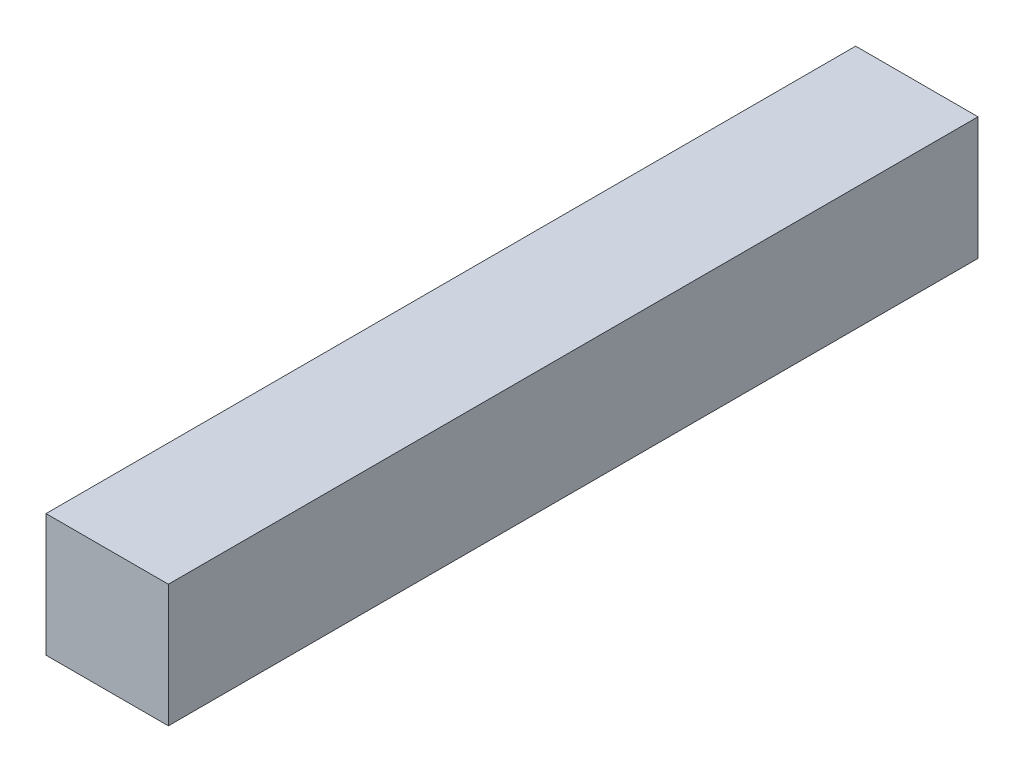
ISO-10303-21;
HEADER;
FILE_DESCRIPTION(('STEP AP214'),'2;1');
FILE_NAME('part.step','',(''),(''),'','','');
FILE_SCHEMA(('AUTOMOTIVE_DESIGN { 1 0 10303 214 1 1 1 1 }'));
ENDSEC;
DATA;
#1=APPLICATION_CONTEXT('core data for automotive mechanical design processes');
#2=APPLICATION_PROTOCOL_DEFINITION('international standard','automotive_design',2000,#1);
#3=PRODUCT_CONTEXT('',#1,'mechanical');
#4=PRODUCT('Part','Part','',(#3));
#5=PRODUCT_RELATED_PRODUCT_CATEGORY('part','',(#4));
#6=PRODUCT_DEFINITION_FORMATION('','',#4);
#7=PRODUCT_DEFINITION_CONTEXT('part definition',#1,'design');
#8=PRODUCT_DEFINITION('design','',#6,#7);
#9=PRODUCT_DEFINITION_SHAPE('','',#8);
#10=(LENGTH_UNIT() NAMED_UNIT(*) SI_UNIT(.MILLI.,.METRE.));
#11=(NAMED_UNIT(*) PLANE_ANGLE_UNIT() SI_UNIT($,.RADIAN.));
#12=(NAMED_UNIT(*) SI_UNIT($,.STERADIAN.) SOLID_ANGLE_UNIT());
#13=UNCERTAINTY_MEASURE_WITH_UNIT(LENGTH_MEASURE(1.E-05),#10,'distance_accuracy_value','');
#14=(GEOMETRIC_REPRESENTATION_CONTEXT(3) GLOBAL_UNCERTAINTY_ASSIGNED_CONTEXT((#13)) GLOBAL_UNIT_ASSIGNED_CONTEXT((#10,
#11,#12)) REPRESENTATION_CONTEXT('',''));
#15=CARTESIAN_POINT('',(0.,0.,0.));
#16=DIRECTION('',(0.,0.,1.));
#17=DIRECTION('',(1.,0.,0.));
#18=AXIS2_PLACEMENT_3D('',#15,#16,#17);
#19=CARTESIAN_POINT('',(-0.24937212,0.2499995,0.));
#20=DIRECTION('',(1.,0.,0.));
#21=DIRECTION('',(0.,0.,-1.));
#22=AXIS2_PLACEMENT_3D('',#19,#20,#21);
#23=PLANE('',#22);
#24=DIRECTION('',(0.,0.,1.));
#25=VECTOR('',#24,1.);
#26=CARTESIAN_POINT('',(-0.24937212,-0.2499995,0.));
#27=LINE('',#26,#25);
#28=CARTESIAN_POINT('',(-0.24937212,-0.2499995,0.));
#29=VERTEX_POINT('',#28);
#30=CARTESIAN_POINT('',(-0.24937212,-0.2499995,3.29999848));
#31=VERTEX_POINT('',#30);
#32=EDGE_CURVE('E65',#29,#31,#27,.T.);
#33=ORIENTED_EDGE('',*,*,#32,.T.);
#34=DIRECTION('',(0.,1.,0.));
#35=VECTOR('',#34,1.);
#36=CARTESIAN_POINT('',(-0.24937212,-0.2499995,3.29999848));
#37=LINE('',#36,#35);
#38=CARTESIAN_POINT('',(-0.24937212,0.2499995,3.29999848));
#39=VERTEX_POINT('',#38);
#40=EDGE_CURVE('E55',#31,#39,#37,.T.);
#41=ORIENTED_EDGE('',*,*,#40,.T.);
#42=DIRECTION('',(0.,0.,-1.));
#43=VECTOR('',#42,1.);
#44=CARTESIAN_POINT('',(-0.24937212,0.2499995,0.));
#45=LINE('',#44,#43);
#46=CARTESIAN_POINT('',(-0.24937212,0.2499995,0.));
#47=VERTEX_POINT('',#46);
#48=EDGE_CURVE('E75',#39,#47,#45,.T.);
#49=ORIENTED_EDGE('',*,*,#48,.T.);
#50=DIRECTION('',(0.,1.,0.));
#51=VECTOR('',#50,1.);
#52=CARTESIAN_POINT('',(-0.24937212,0.2499995,0.));
#53=LINE('',#52,#51);
#54=EDGE_CURVE('E20',#29,#47,#53,.T.);
#55=ORIENTED_EDGE('',*,*,#54,.F.);
#56=EDGE_LOOP('',(#33,#41,#49,#55));
#57=FACE_BOUND('',#56,.T.);
#58=ADVANCED_FACE('F17',(#57),#23,.F.);
#59=CARTESIAN_POINT('',(-0.24937212,-0.2499995,0.));
#60=DIRECTION('',(0.,1.,0.));
#61=DIRECTION('',(0.,0.,1.));
#62=AXIS2_PLACEMENT_3D('',#59,#60,#61);
#63=PLANE('',#62);
#64=DIRECTION('',(0.,0.,1.));
#65=VECTOR('',#64,1.);
#66=CARTESIAN_POINT('',(0.24937212,-0.2499995,0.));
#67=LINE('',#66,#65);
#68=CARTESIAN_POINT('',(0.24937212,-0.2499995,0.));
#69=VERTEX_POINT('',#68);
#70=CARTESIAN_POINT('',(0.24937212,-0.2499995,3.29999848));
#71=VERTEX_POINT('',#70);
#72=EDGE_CURVE('E73',#69,#71,#67,.T.);
#73=ORIENTED_EDGE('',*,*,#72,.T.);
#74=DIRECTION('',(-1.,0.,0.));
#75=VECTOR('',#74,1.);
#76=CARTESIAN_POINT('',(-0.24937212,-0.2499995,3.29999848));
#77=LINE('',#76,#75);
#78=EDGE_CURVE('E62',#71,#31,#77,.T.);
#79=ORIENTED_EDGE('',*,*,#78,.T.);
#80=ORIENTED_EDGE('',*,*,#32,.F.);
#81=DIRECTION('',(-1.,0.,0.));
#82=VECTOR('',#81,1.);
#83=CARTESIAN_POINT('',(-0.24937212,-0.2499995,0.));
#84=LINE('',#83,#82);
#85=EDGE_CURVE('E80',#69,#29,#84,.T.);
#86=ORIENTED_EDGE('',*,*,#85,.F.);
#87=EDGE_LOOP('',(#73,#79,#80,#86));
#88=FACE_BOUND('',#87,.T.);
#89=ADVANCED_FACE('F72',(#88),#63,.F.);
#90=CARTESIAN_POINT('',(-0.24937212,-0.2499995,3.29999848));
#91=DIRECTION('',(0.,0.,-1.));
#92=DIRECTION('',(-1.,0.,0.));
#93=AXIS2_PLACEMENT_3D('',#90,#91,#92);
#94=PLANE('',#93);
#95=DIRECTION('',(0.,1.,0.));
#96=VECTOR('',#95,1.);
#97=CARTESIAN_POINT('',(0.24937212,-0.2499995,3.29999848));
#98=LINE('',#97,#96);
#99=CARTESIAN_POINT('',(0.24937212,0.2499995,3.29999848));
#100=VERTEX_POINT('',#99);
#101=EDGE_CURVE('E83',#71,#100,#98,.T.);
#102=ORIENTED_EDGE('',*,*,#101,.T.);
#103=DIRECTION('',(1.,0.,0.));
#104=VECTOR('',#103,1.);
#105=CARTESIAN_POINT('',(0.24937212,0.2499995,3.29999848));
#106=LINE('',#105,#104);
#107=EDGE_CURVE('E64',#100,#39,#106,.F.);
#108=ORIENTED_EDGE('',*,*,#107,.T.);
#109=ORIENTED_EDGE('',*,*,#40,.F.);
#110=ORIENTED_EDGE('',*,*,#78,.F.);
#111=EDGE_LOOP('',(#102,#108,#109,#110));
#112=FACE_BOUND('',#111,.T.);
#113=ADVANCED_FACE('F60',(#112),#94,.F.);
#114=CARTESIAN_POINT('',(0.24937212,0.2499995,0.));
#115=DIRECTION('',(0.,-1.,0.));
#116=DIRECTION('',(0.,0.,-1.));
#117=AXIS2_PLACEMENT_3D('',#114,#115,#116);
#118=PLANE('',#117);
#119=ORIENTED_EDGE('',*,*,#48,.F.);
#120=ORIENTED_EDGE('',*,*,#107,.F.);
#121=DIRECTION('',(0.,0.,1.));
#122=VECTOR('',#121,1.);
#123=CARTESIAN_POINT('',(0.24937212,0.2499995,0.));
#124=LINE('',#123,#122);
#125=CARTESIAN_POINT('',(0.24937212,0.2499995,0.));
#126=VERTEX_POINT('',#125);
#127=EDGE_CURVE('E26',#100,#126,#124,.F.);
#128=ORIENTED_EDGE('',*,*,#127,.T.);
#129=DIRECTION('',(-1.,0.,0.));
#130=VECTOR('',#129,1.);
#131=CARTESIAN_POINT('',(-0.24937212,0.2499995,0.));
#132=LINE('',#131,#130);
#133=EDGE_CURVE('E34',#47,#126,#132,.F.);
#134=ORIENTED_EDGE('',*,*,#133,.F.);
#135=EDGE_LOOP('',(#119,#120,#128,#134));
#136=FACE_BOUND('',#135,.T.);
#137=ADVANCED_FACE('F88',(#136),#118,.F.);
#138=CARTESIAN_POINT('',(-0.24937212,-0.2499995,0.));
#139=DIRECTION('',(0.,0.,-1.));
#140=DIRECTION('',(-1.,0.,0.));
#141=AXIS2_PLACEMENT_3D('',#138,#139,#140);
#142=PLANE('',#141);
#143=DIRECTION('',(0.,1.,0.));
#144=VECTOR('',#143,1.);
#145=CARTESIAN_POINT('',(0.24937212,-0.2499995,0.));
#146=LINE('',#145,#144);
#147=EDGE_CURVE('E11',#126,#69,#146,.F.);
#148=ORIENTED_EDGE('',*,*,#147,.T.);
#149=ORIENTED_EDGE('',*,*,#85,.T.);
#150=ORIENTED_EDGE('',*,*,#54,.T.);
#151=ORIENTED_EDGE('',*,*,#133,.T.);
#152=EDGE_LOOP('',(#148,#149,#150,#151));
#153=FACE_BOUND('',#152,.T.);
#154=ADVANCED_FACE('F91',(#153),#142,.T.);
#155=CARTESIAN_POINT('',(0.24937212,-0.2499995,0.));
#156=DIRECTION('',(-1.,0.,0.));
#157=DIRECTION('',(0.,0.,1.));
#158=AXIS2_PLACEMENT_3D('',#155,#156,#157);
#159=PLANE('',#158);
#160=ORIENTED_EDGE('',*,*,#127,.F.);
#161=ORIENTED_EDGE('',*,*,#101,.F.);
#162=ORIENTED_EDGE('',*,*,#72,.F.);
#163=ORIENTED_EDGE('',*,*,#147,.F.);
#164=EDGE_LOOP('',(#160,#161,#162,#163));
#165=FACE_BOUND('',#164,.T.);
#166=ADVANCED_FACE('F90',(#165),#159,.F.);
#167=CLOSED_SHELL('',(#58,#89,#113,#137,#154,#166));
#168=MANIFOLD_SOLID_BREP('B1',#167);
#169=ADVANCED_BREP_SHAPE_REPRESENTATION('',(#18,#168),#14);
#170=SHAPE_DEFINITION_REPRESENTATION(#9,#169);
ENDSEC;
END-ISO-10303-21;
